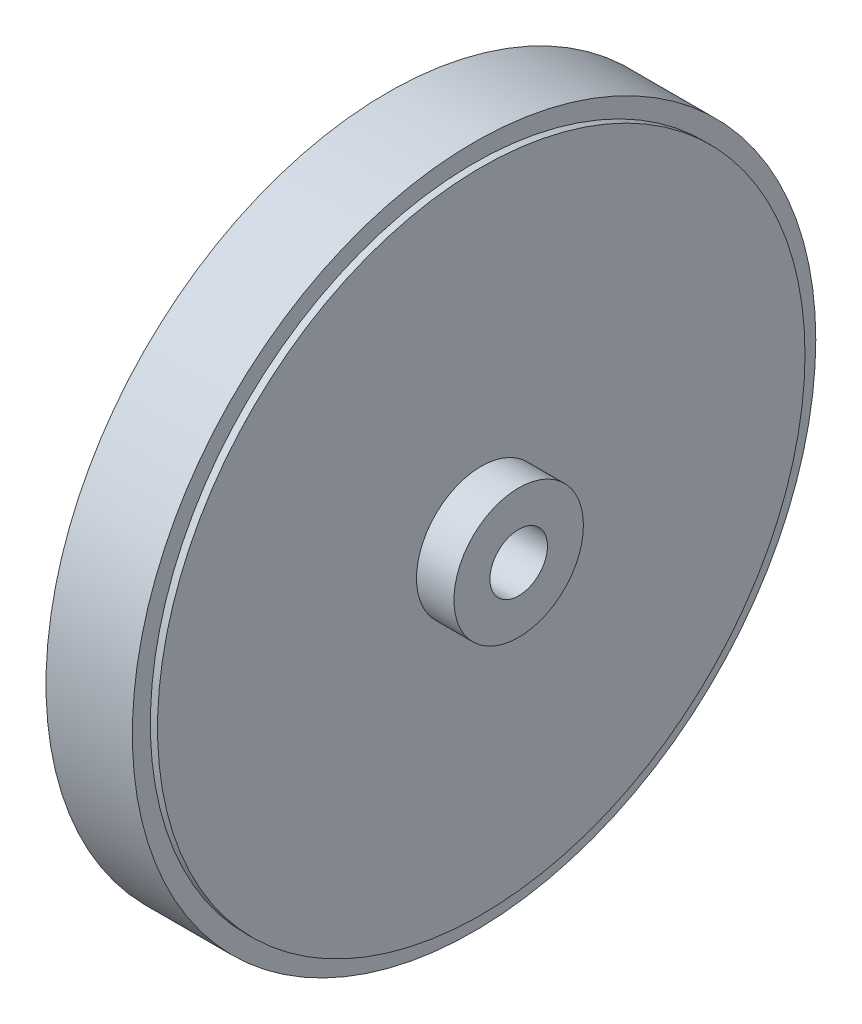
ISO-10303-21;
HEADER;
FILE_DESCRIPTION(('STEP AP214'),'2;1');
FILE_NAME('part.step','',(''),(''),'','','');
FILE_SCHEMA(('AUTOMOTIVE_DESIGN { 1 0 10303 214 1 1 1 1 }'));
ENDSEC;
DATA;
#1=APPLICATION_CONTEXT('core data for automotive mechanical design processes');
#2=APPLICATION_PROTOCOL_DEFINITION('international standard','automotive_design',2000,#1);
#3=PRODUCT_CONTEXT('',#1,'mechanical');
#4=PRODUCT('Part','Part','',(#3));
#5=PRODUCT_RELATED_PRODUCT_CATEGORY('part','',(#4));
#6=PRODUCT_DEFINITION_FORMATION('','',#4);
#7=PRODUCT_DEFINITION_CONTEXT('part definition',#1,'design');
#8=PRODUCT_DEFINITION('design','',#6,#7);
#9=PRODUCT_DEFINITION_SHAPE('','',#8);
#10=(LENGTH_UNIT() NAMED_UNIT(*) SI_UNIT(.MILLI.,.METRE.));
#11=(NAMED_UNIT(*) PLANE_ANGLE_UNIT() SI_UNIT($,.RADIAN.));
#12=(NAMED_UNIT(*) SI_UNIT($,.STERADIAN.) SOLID_ANGLE_UNIT());
#13=UNCERTAINTY_MEASURE_WITH_UNIT(LENGTH_MEASURE(1.E-05),#10,'distance_accuracy_value','');
#14=(GEOMETRIC_REPRESENTATION_CONTEXT(3) GLOBAL_UNCERTAINTY_ASSIGNED_CONTEXT((#13)) GLOBAL_UNIT_ASSIGNED_CONTEXT((#10,
#11,#12)) REPRESENTATION_CONTEXT('',''));
#15=CARTESIAN_POINT('',(0.,0.,0.));
#16=DIRECTION('',(0.,0.,1.));
#17=DIRECTION('',(1.,0.,0.));
#18=AXIS2_PLACEMENT_3D('',#15,#16,#17);
#19=CARTESIAN_POINT('',(13.,0.,0.));
#20=DIRECTION('',(1.,0.,0.));
#21=DIRECTION('',(0.,0.,-1.));
#22=AXIS2_PLACEMENT_3D('',#19,#20,#21);
#23=PLANE('',#22);
#24=CARTESIAN_POINT('',(13.,0.,0.));
#25=DIRECTION('',(1.,0.,0.));
#26=DIRECTION('',(0.,0.,-1.));
#27=AXIS2_PLACEMENT_3D('',#24,#25,#26);
#28=CIRCLE('',#27,45.);
#29=CARTESIAN_POINT('',(13.,0.,-45.));
#30=VERTEX_POINT('',#29);
#31=EDGE_CURVE('E63',#30,#30,#28,.T.);
#32=ORIENTED_EDGE('',*,*,#31,.T.);
#33=EDGE_LOOP('',(#32));
#34=FACE_BOUND('',#33,.T.);
#35=CARTESIAN_POINT('',(13.,0.,0.));
#36=DIRECTION('',(1.,0.,0.));
#37=DIRECTION('',(0.,0.,-1.));
#38=AXIS2_PLACEMENT_3D('',#35,#36,#37);
#39=CIRCLE('',#38,9.);
#40=CARTESIAN_POINT('',(13.,0.,-9.));
#41=VERTEX_POINT('',#40);
#42=EDGE_CURVE('E70',#41,#41,#39,.T.);
#43=ORIENTED_EDGE('',*,*,#42,.F.);
#44=EDGE_LOOP('',(#43));
#45=FACE_BOUND('',#44,.T.);
#46=ADVANCED_FACE('F34',(#34,#45),#23,.T.);
#47=CARTESIAN_POINT('',(12.,0.,0.));
#48=DIRECTION('',(1.,0.,0.));
#49=DIRECTION('',(0.,0.,-1.));
#50=AXIS2_PLACEMENT_3D('',#47,#48,#49);
#51=PLANE('',#50);
#52=CARTESIAN_POINT('',(12.,0.,0.));
#53=DIRECTION('',(1.,0.,0.));
#54=DIRECTION('',(0.,0.,-1.));
#55=AXIS2_PLACEMENT_3D('',#52,#53,#54);
#56=CIRCLE('',#55,45.);
#57=CARTESIAN_POINT('',(12.,0.,-45.));
#58=VERTEX_POINT('',#57);
#59=EDGE_CURVE('E10',#58,#58,#56,.T.);
#60=ORIENTED_EDGE('',*,*,#59,.F.);
#61=EDGE_LOOP('',(#60));
#62=FACE_BOUND('',#61,.T.);
#63=CARTESIAN_POINT('',(12.,0.,0.));
#64=DIRECTION('',(1.,0.,0.));
#65=DIRECTION('',(0.,0.,-1.));
#66=AXIS2_PLACEMENT_3D('',#63,#64,#65);
#67=CIRCLE('',#66,47.5);
#68=CARTESIAN_POINT('',(12.,0.,-47.5));
#69=VERTEX_POINT('',#68);
#70=EDGE_CURVE('E42',#69,#69,#67,.T.);
#71=ORIENTED_EDGE('',*,*,#70,.T.);
#72=EDGE_LOOP('',(#71));
#73=FACE_BOUND('',#72,.T.);
#74=ADVANCED_FACE('F96',(#62,#73),#51,.T.);
#75=CARTESIAN_POINT('',(0.,0.,0.));
#76=DIRECTION('',(1.,0.,0.));
#77=DIRECTION('',(0.,0.,-1.));
#78=AXIS2_PLACEMENT_3D('',#75,#76,#77);
#79=PLANE('',#78);
#80=CARTESIAN_POINT('',(0.,0.,0.));
#81=DIRECTION('',(1.,0.,0.));
#82=DIRECTION('',(0.,0.,-1.));
#83=AXIS2_PLACEMENT_3D('',#80,#81,#82);
#84=CIRCLE('',#83,45.);
#85=CARTESIAN_POINT('',(0.,0.,-45.));
#86=VERTEX_POINT('',#85);
#87=EDGE_CURVE('E38',#86,#86,#84,.T.);
#88=ORIENTED_EDGE('',*,*,#87,.T.);
#89=EDGE_LOOP('',(#88));
#90=FACE_BOUND('',#89,.T.);
#91=CARTESIAN_POINT('',(0.,0.,0.));
#92=DIRECTION('',(1.,0.,0.));
#93=DIRECTION('',(0.,0.,-1.));
#94=AXIS2_PLACEMENT_3D('',#91,#92,#93);
#95=CIRCLE('',#94,47.5);
#96=CARTESIAN_POINT('',(0.,0.,-47.5));
#97=VERTEX_POINT('',#96);
#98=EDGE_CURVE('E47',#97,#97,#95,.T.);
#99=ORIENTED_EDGE('',*,*,#98,.F.);
#100=EDGE_LOOP('',(#99));
#101=FACE_BOUND('',#100,.T.);
#102=ADVANCED_FACE('F102',(#90,#101),#79,.F.);
#103=CARTESIAN_POINT('',(12.,0.,0.));
#104=DIRECTION('',(-1.,0.,0.));
#105=DIRECTION('',(0.,0.,1.));
#106=AXIS2_PLACEMENT_3D('',#103,#104,#105);
#107=CYLINDRICAL_SURFACE('',#106,47.5);
#108=ORIENTED_EDGE('',*,*,#70,.F.);
#109=EDGE_LOOP('',(#108));
#110=FACE_BOUND('',#109,.T.);
#111=ORIENTED_EDGE('',*,*,#98,.T.);
#112=EDGE_LOOP('',(#111));
#113=FACE_BOUND('',#112,.T.);
#114=ADVANCED_FACE('F36',(#110,#113),#107,.T.);
#115=CARTESIAN_POINT('',(-0.999999999999999,0.,0.));
#116=DIRECTION('',(1.,0.,0.));
#117=DIRECTION('',(0.,0.,-1.));
#118=AXIS2_PLACEMENT_3D('',#115,#116,#117);
#119=CYLINDRICAL_SURFACE('',#118,45.);
#120=CARTESIAN_POINT('',(-0.999999999999999,0.,0.));
#121=DIRECTION('',(1.,0.,0.));
#122=DIRECTION('',(0.,0.,-1.));
#123=AXIS2_PLACEMENT_3D('',#120,#121,#122);
#124=CIRCLE('',#123,45.);
#125=CARTESIAN_POINT('',(-0.999999999999999,0.,-45.));
#126=VERTEX_POINT('',#125);
#127=EDGE_CURVE('E50',#126,#126,#124,.T.);
#128=ORIENTED_EDGE('',*,*,#127,.T.);
#129=EDGE_LOOP('',(#128));
#130=FACE_BOUND('',#129,.T.);
#131=ORIENTED_EDGE('',*,*,#87,.F.);
#132=EDGE_LOOP('',(#131));
#133=FACE_BOUND('',#132,.T.);
#134=ADVANCED_FACE('F94',(#130,#133),#119,.T.);
#135=CARTESIAN_POINT('',(-0.999999999999999,0.,0.));
#136=DIRECTION('',(1.,0.,0.));
#137=DIRECTION('',(0.,0.,-1.));
#138=AXIS2_PLACEMENT_3D('',#135,#136,#137);
#139=PLANE('',#138);
#140=CARTESIAN_POINT('',(-0.999999999999999,0.,0.));
#141=DIRECTION('',(1.,0.,0.));
#142=DIRECTION('',(0.,0.,-1.));
#143=AXIS2_PLACEMENT_3D('',#140,#141,#142);
#144=CIRCLE('',#143,4.);
#145=CARTESIAN_POINT('',(-0.999999999999999,0.,-4.));
#146=VERTEX_POINT('',#145);
#147=EDGE_CURVE('E59',#146,#146,#144,.T.);
#148=ORIENTED_EDGE('',*,*,#147,.T.);
#149=EDGE_LOOP('',(#148));
#150=FACE_BOUND('',#149,.T.);
#151=ORIENTED_EDGE('',*,*,#127,.F.);
#152=EDGE_LOOP('',(#151));
#153=FACE_BOUND('',#152,.T.);
#154=ADVANCED_FACE('F107',(#150,#153),#139,.F.);
#155=CARTESIAN_POINT('',(12.,0.,0.));
#156=DIRECTION('',(-1.,0.,0.));
#157=DIRECTION('',(0.,0.,1.));
#158=AXIS2_PLACEMENT_3D('',#155,#156,#157);
#159=CYLINDRICAL_SURFACE('',#158,4.);
#160=ORIENTED_EDGE('',*,*,#147,.F.);
#161=EDGE_LOOP('',(#160));
#162=FACE_BOUND('',#161,.T.);
#163=CARTESIAN_POINT('',(18.2,0.,0.));
#164=DIRECTION('',(1.,0.,0.));
#165=DIRECTION('',(0.,0.,-1.));
#166=AXIS2_PLACEMENT_3D('',#163,#164,#165);
#167=CIRCLE('',#166,4.);
#168=CARTESIAN_POINT('',(18.2,0.,-4.));
#169=VERTEX_POINT('',#168);
#170=EDGE_CURVE('E73',#169,#169,#167,.T.);
#171=ORIENTED_EDGE('',*,*,#170,.T.);
#172=EDGE_LOOP('',(#171));
#173=FACE_BOUND('',#172,.T.);
#174=ADVANCED_FACE('F79',(#162,#173),#159,.F.);
#175=ORIENTED_EDGE('',*,*,#59,.T.);
#176=EDGE_LOOP('',(#175));
#177=FACE_BOUND('',#176,.T.);
#178=ORIENTED_EDGE('',*,*,#31,.F.);
#179=EDGE_LOOP('',(#178));
#180=FACE_BOUND('',#179,.T.);
#181=ADVANCED_FACE('F84',(#177,#180),#119,.T.);
#182=CARTESIAN_POINT('',(18.2,0.,0.));
#183=DIRECTION('',(1.,0.,0.));
#184=DIRECTION('',(0.,0.,-1.));
#185=AXIS2_PLACEMENT_3D('',#182,#183,#184);
#186=PLANE('',#185);
#187=CARTESIAN_POINT('',(18.2,0.,0.));
#188=DIRECTION('',(1.,0.,0.));
#189=DIRECTION('',(0.,0.,-1.));
#190=AXIS2_PLACEMENT_3D('',#187,#188,#189);
#191=CIRCLE('',#190,9.);
#192=CARTESIAN_POINT('',(18.2,0.,-9.));
#193=VERTEX_POINT('',#192);
#194=EDGE_CURVE('E67',#193,#193,#191,.T.);
#195=ORIENTED_EDGE('',*,*,#194,.T.);
#196=EDGE_LOOP('',(#195));
#197=FACE_BOUND('',#196,.T.);
#198=ORIENTED_EDGE('',*,*,#170,.F.);
#199=EDGE_LOOP('',(#198));
#200=FACE_BOUND('',#199,.T.);
#201=ADVANCED_FACE('F81',(#197,#200),#186,.T.);
#202=CARTESIAN_POINT('',(18.2,0.,0.));
#203=DIRECTION('',(-1.,0.,0.));
#204=DIRECTION('',(0.,0.,1.));
#205=AXIS2_PLACEMENT_3D('',#202,#203,#204);
#206=CYLINDRICAL_SURFACE('',#205,9.);
#207=ORIENTED_EDGE('',*,*,#194,.F.);
#208=EDGE_LOOP('',(#207));
#209=FACE_BOUND('',#208,.T.);
#210=ORIENTED_EDGE('',*,*,#42,.T.);
#211=EDGE_LOOP('',(#210));
#212=FACE_BOUND('',#211,.T.);
#213=ADVANCED_FACE('F83',(#209,#212),#206,.T.);
#214=CLOSED_SHELL('',(#46,#74,#102,#114,#134,#154,#174,#181,#201,#213));
#215=MANIFOLD_SOLID_BREP('B2',#214);
#216=ADVANCED_BREP_SHAPE_REPRESENTATION('',(#18,#215),#14);
#217=SHAPE_DEFINITION_REPRESENTATION(#9,#216);
ENDSEC;
END-ISO-10303-21;
